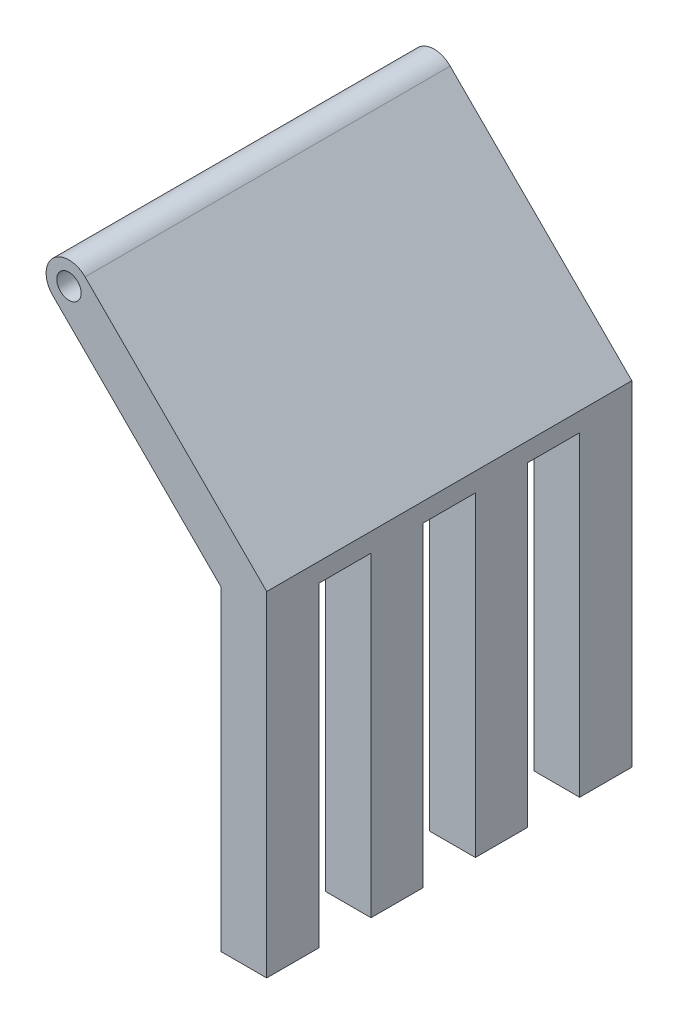
ISO-10303-21;
HEADER;
FILE_DESCRIPTION(('STEP AP214'),'2;1');
FILE_NAME('part.step','',(''),(''),'','','');
FILE_SCHEMA(('AUTOMOTIVE_DESIGN { 1 0 10303 214 1 1 1 1 }'));
ENDSEC;
DATA;
#1=APPLICATION_CONTEXT('core data for automotive mechanical design processes');
#2=APPLICATION_PROTOCOL_DEFINITION('international standard','automotive_design',2000,#1);
#3=PRODUCT_CONTEXT('',#1,'mechanical');
#4=PRODUCT('Part','Part','',(#3));
#5=PRODUCT_RELATED_PRODUCT_CATEGORY('part','',(#4));
#6=PRODUCT_DEFINITION_FORMATION('','',#4);
#7=PRODUCT_DEFINITION_CONTEXT('part definition',#1,'design');
#8=PRODUCT_DEFINITION('design','',#6,#7);
#9=PRODUCT_DEFINITION_SHAPE('','',#8);
#10=(LENGTH_UNIT() NAMED_UNIT(*) SI_UNIT(.MILLI.,.METRE.));
#11=(NAMED_UNIT(*) PLANE_ANGLE_UNIT() SI_UNIT($,.RADIAN.));
#12=(NAMED_UNIT(*) SI_UNIT($,.STERADIAN.) SOLID_ANGLE_UNIT());
#13=UNCERTAINTY_MEASURE_WITH_UNIT(LENGTH_MEASURE(1.E-05),#10,'distance_accuracy_value','');
#14=(GEOMETRIC_REPRESENTATION_CONTEXT(3) GLOBAL_UNCERTAINTY_ASSIGNED_CONTEXT((#13)) GLOBAL_UNIT_ASSIGNED_CONTEXT((#10,
#11,#12)) REPRESENTATION_CONTEXT('',''));
#15=CARTESIAN_POINT('',(0.,0.,0.));
#16=DIRECTION('',(0.,0.,1.));
#17=DIRECTION('',(1.,0.,0.));
#18=AXIS2_PLACEMENT_3D('',#15,#16,#17);
#19=CARTESIAN_POINT('',(0.,0.,60.));
#20=DIRECTION('',(0.,1.,0.));
#21=DIRECTION('',(0.,0.,1.));
#22=AXIS2_PLACEMENT_3D('',#19,#20,#21);
#23=PLANE('',#22);
#24=DIRECTION('',(0.,0.,-1.));
#25=VECTOR('',#24,1.);
#26=CARTESIAN_POINT('',(7.5,0.,60.));
#27=LINE('',#26,#25);
#28=CARTESIAN_POINT('',(7.5,0.,8.57142857142857));
#29=VERTEX_POINT('',#28);
#30=CARTESIAN_POINT('',(7.5,0.,0.));
#31=VERTEX_POINT('',#30);
#32=EDGE_CURVE('E44',#29,#31,#27,.T.);
#33=ORIENTED_EDGE('',*,*,#32,.F.);
#34=DIRECTION('',(-1.,0.,0.));
#35=VECTOR('',#34,1.);
#36=CARTESIAN_POINT('',(7.5,0.,8.57142857142857));
#37=LINE('',#36,#35);
#38=CARTESIAN_POINT('',(0.,0.,8.57142857142857));
#39=VERTEX_POINT('',#38);
#40=EDGE_CURVE('E276',#29,#39,#37,.T.);
#41=ORIENTED_EDGE('',*,*,#40,.T.);
#42=DIRECTION('',(0.,0.,-1.));
#43=VECTOR('',#42,1.);
#44=CARTESIAN_POINT('',(0.,0.,60.));
#45=LINE('',#44,#43);
#46=CARTESIAN_POINT('',(0.,0.,0.));
#47=VERTEX_POINT('',#46);
#48=EDGE_CURVE('E218',#39,#47,#45,.T.);
#49=ORIENTED_EDGE('',*,*,#48,.T.);
#50=DIRECTION('',(1.,0.,0.));
#51=VECTOR('',#50,1.);
#52=CARTESIAN_POINT('',(0.,0.,0.));
#53=LINE('',#52,#51);
#54=EDGE_CURVE('E232',#47,#31,#53,.T.);
#55=ORIENTED_EDGE('',*,*,#54,.T.);
#56=EDGE_LOOP('',(#33,#41,#49,#55));
#57=FACE_BOUND('',#56,.T.);
#58=ADVANCED_FACE('F35',(#57),#23,.F.);
#59=CARTESIAN_POINT('',(7.5,0.,42.8571428571429));
#60=VERTEX_POINT('',#59);
#61=CARTESIAN_POINT('',(7.5,0.,34.2857142857143));
#62=VERTEX_POINT('',#61);
#63=EDGE_CURVE('E43',#60,#62,#27,.T.);
#64=ORIENTED_EDGE('',*,*,#63,.F.);
#65=DIRECTION('',(-1.,0.,0.));
#66=VECTOR('',#65,1.);
#67=CARTESIAN_POINT('',(7.5,0.,42.8571428571429));
#68=LINE('',#67,#66);
#69=CARTESIAN_POINT('',(0.,0.,42.8571428571429));
#70=VERTEX_POINT('',#69);
#71=EDGE_CURVE('E163',#60,#70,#68,.T.);
#72=ORIENTED_EDGE('',*,*,#71,.T.);
#73=CARTESIAN_POINT('',(0.,0.,34.2857142857143));
#74=VERTEX_POINT('',#73);
#75=EDGE_CURVE('E217',#70,#74,#45,.T.);
#76=ORIENTED_EDGE('',*,*,#75,.T.);
#77=DIRECTION('',(-1.,0.,0.));
#78=VECTOR('',#77,1.);
#79=CARTESIAN_POINT('',(7.5,0.,34.2857142857143));
#80=LINE('',#79,#78);
#81=EDGE_CURVE('E59',#62,#74,#80,.T.);
#82=ORIENTED_EDGE('',*,*,#81,.F.);
#83=EDGE_LOOP('',(#64,#72,#76,#82));
#84=FACE_BOUND('',#83,.T.);
#85=ADVANCED_FACE('F187',(#84),#23,.F.);
#86=CARTESIAN_POINT('',(0.,0.,25.7142857142857));
#87=VERTEX_POINT('',#86);
#88=CARTESIAN_POINT('',(0.,0.,17.1428571428571));
#89=VERTEX_POINT('',#88);
#90=EDGE_CURVE('E331',#87,#89,#45,.T.);
#91=ORIENTED_EDGE('',*,*,#90,.T.);
#92=DIRECTION('',(-1.,0.,0.));
#93=VECTOR('',#92,1.);
#94=CARTESIAN_POINT('',(7.5,0.,17.1428571428571));
#95=LINE('',#94,#93);
#96=CARTESIAN_POINT('',(7.5,0.,17.1428571428571));
#97=VERTEX_POINT('',#96);
#98=EDGE_CURVE('E51',#97,#89,#95,.T.);
#99=ORIENTED_EDGE('',*,*,#98,.F.);
#100=CARTESIAN_POINT('',(7.5,0.,25.7142857142857));
#101=VERTEX_POINT('',#100);
#102=EDGE_CURVE('E188',#101,#97,#27,.T.);
#103=ORIENTED_EDGE('',*,*,#102,.F.);
#104=DIRECTION('',(-1.,0.,0.));
#105=VECTOR('',#104,1.);
#106=CARTESIAN_POINT('',(7.5,0.,25.7142857142857));
#107=LINE('',#106,#105);
#108=EDGE_CURVE('E254',#101,#87,#107,.T.);
#109=ORIENTED_EDGE('',*,*,#108,.T.);
#110=EDGE_LOOP('',(#91,#99,#103,#109));
#111=FACE_BOUND('',#110,.T.);
#112=ADVANCED_FACE('F369',(#111),#23,.F.);
#113=CARTESIAN_POINT('',(0.,0.,60.));
#114=DIRECTION('',(1.,0.,0.));
#115=DIRECTION('',(0.,1.,0.));
#116=AXIS2_PLACEMENT_3D('',#113,#114,#115);
#117=PLANE('',#116);
#118=ORIENTED_EDGE('',*,*,#48,.F.);
#119=DIRECTION('',(0.,-1.,0.));
#120=VECTOR('',#119,1.);
#121=CARTESIAN_POINT('',(0.,51.8933982822018,8.57142857142856));
#122=LINE('',#121,#120);
#123=CARTESIAN_POINT('',(0.,51.8933982822018,8.57142857142856));
#124=VERTEX_POINT('',#123);
#125=EDGE_CURVE('E291',#124,#39,#122,.T.);
#126=ORIENTED_EDGE('',*,*,#125,.F.);
#127=DIRECTION('',(0.,0.,-1.));
#128=VECTOR('',#127,1.);
#129=CARTESIAN_POINT('',(0.,51.8933982822018,60.));
#130=LINE('',#129,#128);
#131=CARTESIAN_POINT('',(0.,51.8933982822018,0.));
#132=VERTEX_POINT('',#131);
#133=EDGE_CURVE('E213',#124,#132,#130,.T.);
#134=ORIENTED_EDGE('',*,*,#133,.T.);
#135=DIRECTION('',(0.,-1.,0.));
#136=VECTOR('',#135,1.);
#137=CARTESIAN_POINT('',(0.,0.,0.));
#138=LINE('',#137,#136);
#139=EDGE_CURVE('E219',#132,#47,#138,.T.);
#140=ORIENTED_EDGE('',*,*,#139,.T.);
#141=EDGE_LOOP('',(#118,#126,#134,#140));
#142=FACE_BOUND('',#141,.T.);
#143=ADVANCED_FACE('F341',(#142),#117,.F.);
#144=ORIENTED_EDGE('',*,*,#75,.F.);
#145=DIRECTION('',(0.,-1.,0.));
#146=VECTOR('',#145,1.);
#147=CARTESIAN_POINT('',(0.,51.8933982822018,42.8571428571429));
#148=LINE('',#147,#146);
#149=CARTESIAN_POINT('',(0.,51.8933982822018,42.8571428571429));
#150=VERTEX_POINT('',#149);
#151=EDGE_CURVE('E169',#150,#70,#148,.T.);
#152=ORIENTED_EDGE('',*,*,#151,.F.);
#153=CARTESIAN_POINT('',(0.,51.8933982822018,34.2857142857143));
#154=VERTEX_POINT('',#153);
#155=EDGE_CURVE('E212',#150,#154,#130,.T.);
#156=ORIENTED_EDGE('',*,*,#155,.T.);
#157=DIRECTION('',(0.,1.,0.));
#158=VECTOR('',#157,1.);
#159=CARTESIAN_POINT('',(0.,51.8933982822018,34.2857142857143));
#160=LINE('',#159,#158);
#161=EDGE_CURVE('E266',#74,#154,#160,.T.);
#162=ORIENTED_EDGE('',*,*,#161,.F.);
#163=EDGE_LOOP('',(#144,#152,#156,#162));
#164=FACE_BOUND('',#163,.T.);
#165=ADVANCED_FACE('F330',(#164),#117,.F.);
#166=CARTESIAN_POINT('',(0.,51.8933982822018,25.7142857142857));
#167=VERTEX_POINT('',#166);
#168=CARTESIAN_POINT('',(0.,51.8933982822018,17.1428571428571));
#169=VERTEX_POINT('',#168);
#170=EDGE_CURVE('E402',#167,#169,#130,.T.);
#171=ORIENTED_EDGE('',*,*,#170,.T.);
#172=DIRECTION('',(0.,1.,0.));
#173=VECTOR('',#172,1.);
#174=CARTESIAN_POINT('',(0.,51.8933982822018,17.1428571428571));
#175=LINE('',#174,#173);
#176=EDGE_CURVE('E289',#89,#169,#175,.T.);
#177=ORIENTED_EDGE('',*,*,#176,.F.);
#178=ORIENTED_EDGE('',*,*,#90,.F.);
#179=DIRECTION('',(0.,-1.,0.));
#180=VECTOR('',#179,1.);
#181=CARTESIAN_POINT('',(0.,51.8933982822018,25.7142857142857));
#182=LINE('',#181,#180);
#183=EDGE_CURVE('E268',#167,#87,#182,.T.);
#184=ORIENTED_EDGE('',*,*,#183,.F.);
#185=EDGE_LOOP('',(#171,#177,#178,#184));
#186=FACE_BOUND('',#185,.T.);
#187=ADVANCED_FACE('F384',(#186),#117,.F.);
#188=CARTESIAN_POINT('',(-25.,82.1966991411008,60.));
#189=DIRECTION('',(0.,0.,-1.));
#190=DIRECTION('',(-1.,0.,0.));
#191=AXIS2_PLACEMENT_3D('',#188,#189,#190);
#192=PLANE('',#191);
#193=DIRECTION('',(1.,0.,0.));
#194=VECTOR('',#193,1.);
#195=CARTESIAN_POINT('',(0.,0.,60.));
#196=LINE('',#195,#194);
#197=CARTESIAN_POINT('',(0.,0.,60.));
#198=VERTEX_POINT('',#197);
#199=CARTESIAN_POINT('',(7.5,0.,60.));
#200=VERTEX_POINT('',#199);
#201=EDGE_CURVE('E222',#198,#200,#196,.T.);
#202=ORIENTED_EDGE('',*,*,#201,.T.);
#203=DIRECTION('',(0.,1.,0.));
#204=VECTOR('',#203,1.);
#205=CARTESIAN_POINT('',(7.5,0.,60.));
#206=LINE('',#205,#204);
#207=CARTESIAN_POINT('',(7.5,55.,60.));
#208=VERTEX_POINT('',#207);
#209=EDGE_CURVE('E244',#200,#208,#206,.T.);
#210=ORIENTED_EDGE('',*,*,#209,.T.);
#211=DIRECTION('',(-0.707106781186549,0.707106781186546,0.));
#212=VECTOR('',#211,1.);
#213=CARTESIAN_POINT('',(7.5,55.,60.));
#214=LINE('',#213,#212);
#215=CARTESIAN_POINT('',(-22.3483495705505,84.8483495705503,60.));
#216=VERTEX_POINT('',#215);
#217=EDGE_CURVE('E242',#208,#216,#214,.T.);
#218=ORIENTED_EDGE('',*,*,#217,.T.);
#219=CARTESIAN_POINT('',(-25.,82.1966991411008,60.));
#220=DIRECTION('',(0.,0.,1.));
#221=DIRECTION('',(-1.,0.,0.));
#222=AXIS2_PLACEMENT_3D('',#219,#220,#221);
#223=CIRCLE('',#222,3.75);
#224=CARTESIAN_POINT('',(-27.6516504294495,79.5450487116512,60.));
#225=VERTEX_POINT('',#224);
#226=EDGE_CURVE('E240',#216,#225,#223,.T.);
#227=ORIENTED_EDGE('',*,*,#226,.T.);
#228=DIRECTION('',(0.707106781186549,-0.707106781186546,0.));
#229=VECTOR('',#228,1.);
#230=CARTESIAN_POINT('',(0.,51.8933982822018,60.));
#231=LINE('',#230,#229);
#232=CARTESIAN_POINT('',(0.,51.8933982822018,60.));
#233=VERTEX_POINT('',#232);
#234=EDGE_CURVE('E238',#225,#233,#231,.T.);
#235=ORIENTED_EDGE('',*,*,#234,.T.);
#236=DIRECTION('',(0.,-1.,0.));
#237=VECTOR('',#236,1.);
#238=CARTESIAN_POINT('',(0.,0.,60.));
#239=LINE('',#238,#237);
#240=EDGE_CURVE('E236',#233,#198,#239,.T.);
#241=ORIENTED_EDGE('',*,*,#240,.T.);
#242=EDGE_LOOP('',(#202,#210,#218,#227,#235,#241));
#243=FACE_BOUND('',#242,.T.);
#244=CARTESIAN_POINT('',(-25.,82.1966991411008,60.));
#245=DIRECTION('',(0.,0.,1.));
#246=DIRECTION('',(1.,0.,0.));
#247=AXIS2_PLACEMENT_3D('',#244,#245,#246);
#248=CIRCLE('',#247,2.);
#249=CARTESIAN_POINT('',(-23.,82.1966991411008,60.));
#250=VERTEX_POINT('',#249);
#251=EDGE_CURVE('E235',#250,#250,#248,.T.);
#252=ORIENTED_EDGE('',*,*,#251,.F.);
#253=EDGE_LOOP('',(#252));
#254=FACE_BOUND('',#253,.T.);
#255=ADVANCED_FACE('F352',(#243,#254),#192,.F.);
#256=CARTESIAN_POINT('',(-25.,82.1966991411008,0.));
#257=DIRECTION('',(0.,0.,-1.));
#258=DIRECTION('',(-1.,0.,0.));
#259=AXIS2_PLACEMENT_3D('',#256,#257,#258);
#260=PLANE('',#259);
#261=ORIENTED_EDGE('',*,*,#54,.F.);
#262=ORIENTED_EDGE('',*,*,#139,.F.);
#263=DIRECTION('',(0.707106781186549,-0.707106781186546,0.));
#264=VECTOR('',#263,1.);
#265=CARTESIAN_POINT('',(0.,51.8933982822018,0.));
#266=LINE('',#265,#264);
#267=CARTESIAN_POINT('',(-27.6516504294495,79.5450487116512,0.));
#268=VERTEX_POINT('',#267);
#269=EDGE_CURVE('E223',#268,#132,#266,.T.);
#270=ORIENTED_EDGE('',*,*,#269,.F.);
#271=CARTESIAN_POINT('',(-25.,82.1966991411008,0.));
#272=DIRECTION('',(0.,0.,1.));
#273=DIRECTION('',(-1.,0.,0.));
#274=AXIS2_PLACEMENT_3D('',#271,#272,#273);
#275=CIRCLE('',#274,3.75);
#276=CARTESIAN_POINT('',(-22.3483495705505,84.8483495705503,0.));
#277=VERTEX_POINT('',#276);
#278=EDGE_CURVE('E226',#277,#268,#275,.T.);
#279=ORIENTED_EDGE('',*,*,#278,.F.);
#280=DIRECTION('',(-0.707106781186549,0.707106781186546,0.));
#281=VECTOR('',#280,1.);
#282=CARTESIAN_POINT('',(7.5,55.,0.));
#283=LINE('',#282,#281);
#284=CARTESIAN_POINT('',(7.5,55.,0.));
#285=VERTEX_POINT('',#284);
#286=EDGE_CURVE('E228',#285,#277,#283,.T.);
#287=ORIENTED_EDGE('',*,*,#286,.F.);
#288=DIRECTION('',(0.,1.,0.));
#289=VECTOR('',#288,1.);
#290=CARTESIAN_POINT('',(7.5,0.,0.));
#291=LINE('',#290,#289);
#292=EDGE_CURVE('E230',#31,#285,#291,.T.);
#293=ORIENTED_EDGE('',*,*,#292,.F.);
#294=EDGE_LOOP('',(#261,#262,#270,#279,#287,#293));
#295=FACE_BOUND('',#294,.T.);
#296=CARTESIAN_POINT('',(-25.,82.1966991411008,0.));
#297=DIRECTION('',(0.,0.,1.));
#298=DIRECTION('',(1.,0.,0.));
#299=AXIS2_PLACEMENT_3D('',#296,#297,#298);
#300=CIRCLE('',#299,2.);
#301=CARTESIAN_POINT('',(-23.,82.1966991411008,0.));
#302=VERTEX_POINT('',#301);
#303=EDGE_CURVE('E248',#302,#302,#300,.T.);
#304=ORIENTED_EDGE('',*,*,#303,.T.);
#305=EDGE_LOOP('',(#304));
#306=FACE_BOUND('',#305,.T.);
#307=ADVANCED_FACE('F345',(#295,#306),#260,.T.);
#308=CARTESIAN_POINT('',(0.,0.,51.4285714285714));
#309=VERTEX_POINT('',#308);
#310=EDGE_CURVE('E214',#198,#309,#45,.T.);
#311=ORIENTED_EDGE('',*,*,#310,.T.);
#312=DIRECTION('',(-1.,0.,0.));
#313=VECTOR('',#312,1.);
#314=CARTESIAN_POINT('',(7.5,0.,51.4285714285714));
#315=LINE('',#314,#313);
#316=CARTESIAN_POINT('',(7.5,0.,51.4285714285714));
#317=VERTEX_POINT('',#316);
#318=EDGE_CURVE('E174',#317,#309,#315,.T.);
#319=ORIENTED_EDGE('',*,*,#318,.F.);
#320=EDGE_CURVE('E11',#200,#317,#27,.T.);
#321=ORIENTED_EDGE('',*,*,#320,.F.);
#322=ORIENTED_EDGE('',*,*,#201,.F.);
#323=EDGE_LOOP('',(#311,#319,#321,#322));
#324=FACE_BOUND('',#323,.T.);
#325=ADVANCED_FACE('F37',(#324),#23,.F.);
#326=CARTESIAN_POINT('',(7.5,0.,60.));
#327=DIRECTION('',(-1.,0.,0.));
#328=DIRECTION('',(0.,0.,1.));
#329=AXIS2_PLACEMENT_3D('',#326,#327,#328);
#330=PLANE('',#329);
#331=DIRECTION('',(0.,0.,-1.));
#332=VECTOR('',#331,1.);
#333=CARTESIAN_POINT('',(7.5,51.8933982822018,8.57142857142856));
#334=LINE('',#333,#332);
#335=CARTESIAN_POINT('',(7.5,51.8933982822018,17.1428571428571));
#336=VERTEX_POINT('',#335);
#337=CARTESIAN_POINT('',(7.5,51.8933982822018,8.57142857142856));
#338=VERTEX_POINT('',#337);
#339=EDGE_CURVE('E279',#336,#338,#334,.T.);
#340=ORIENTED_EDGE('',*,*,#339,.T.);
#341=DIRECTION('',(0.,-1.,0.));
#342=VECTOR('',#341,1.);
#343=CARTESIAN_POINT('',(7.5,51.8933982822018,8.57142857142856));
#344=LINE('',#343,#342);
#345=EDGE_CURVE('E288',#338,#29,#344,.T.);
#346=ORIENTED_EDGE('',*,*,#345,.T.);
#347=ORIENTED_EDGE('',*,*,#32,.T.);
#348=ORIENTED_EDGE('',*,*,#292,.T.);
#349=DIRECTION('',(0.,0.,-1.));
#350=VECTOR('',#349,1.);
#351=CARTESIAN_POINT('',(7.5,55.,60.));
#352=LINE('',#351,#350);
#353=EDGE_CURVE('E193',#208,#285,#352,.T.);
#354=ORIENTED_EDGE('',*,*,#353,.F.);
#355=ORIENTED_EDGE('',*,*,#209,.F.);
#356=ORIENTED_EDGE('',*,*,#320,.T.);
#357=DIRECTION('',(0.,1.,0.));
#358=VECTOR('',#357,1.);
#359=CARTESIAN_POINT('',(7.5,51.8933982822018,51.4285714285714));
#360=LINE('',#359,#358);
#361=CARTESIAN_POINT('',(7.5,51.8933982822018,51.4285714285714));
#362=VERTEX_POINT('',#361);
#363=EDGE_CURVE('E184',#317,#362,#360,.T.);
#364=ORIENTED_EDGE('',*,*,#363,.T.);
#365=DIRECTION('',(0.,0.,-1.));
#366=VECTOR('',#365,1.);
#367=CARTESIAN_POINT('',(7.5,51.8933982822018,42.8571428571429));
#368=LINE('',#367,#366);
#369=CARTESIAN_POINT('',(7.5,51.8933982822018,42.8571428571429));
#370=VERTEX_POINT('',#369);
#371=EDGE_CURVE('E175',#362,#370,#368,.T.);
#372=ORIENTED_EDGE('',*,*,#371,.T.);
#373=DIRECTION('',(0.,-1.,0.));
#374=VECTOR('',#373,1.);
#375=CARTESIAN_POINT('',(7.5,51.8933982822018,42.8571428571429));
#376=LINE('',#375,#374);
#377=EDGE_CURVE('E166',#370,#60,#376,.T.);
#378=ORIENTED_EDGE('',*,*,#377,.T.);
#379=ORIENTED_EDGE('',*,*,#63,.T.);
#380=DIRECTION('',(0.,1.,0.));
#381=VECTOR('',#380,1.);
#382=CARTESIAN_POINT('',(7.5,51.8933982822018,34.2857142857143));
#383=LINE('',#382,#381);
#384=CARTESIAN_POINT('',(7.5,51.8933982822018,34.2857142857143));
#385=VERTEX_POINT('',#384);
#386=EDGE_CURVE('E273',#62,#385,#383,.T.);
#387=ORIENTED_EDGE('',*,*,#386,.T.);
#388=DIRECTION('',(0.,0.,-1.));
#389=VECTOR('',#388,1.);
#390=CARTESIAN_POINT('',(7.5,51.8933982822018,25.7142857142857));
#391=LINE('',#390,#389);
#392=CARTESIAN_POINT('',(7.5,51.8933982822018,25.7142857142857));
#393=VERTEX_POINT('',#392);
#394=EDGE_CURVE('E257',#385,#393,#391,.T.);
#395=ORIENTED_EDGE('',*,*,#394,.T.);
#396=DIRECTION('',(0.,-1.,0.));
#397=VECTOR('',#396,1.);
#398=CARTESIAN_POINT('',(7.5,51.8933982822018,25.7142857142857));
#399=LINE('',#398,#397);
#400=EDGE_CURVE('E265',#393,#101,#399,.T.);
#401=ORIENTED_EDGE('',*,*,#400,.T.);
#402=ORIENTED_EDGE('',*,*,#102,.T.);
#403=DIRECTION('',(0.,1.,0.));
#404=VECTOR('',#403,1.);
#405=CARTESIAN_POINT('',(7.5,51.8933982822018,17.1428571428571));
#406=LINE('',#405,#404);
#407=EDGE_CURVE('E294',#97,#336,#406,.T.);
#408=ORIENTED_EDGE('',*,*,#407,.T.);
#409=EDGE_LOOP('',(#340,#346,#347,#348,#354,#355,#356,#364,#372,#378,#379,#387,#395,#401,#402,#408));
#410=FACE_BOUND('',#409,.T.);
#411=ADVANCED_FACE('F180',(#410),#330,.F.);
#412=CARTESIAN_POINT('',(7.5,55.,60.));
#413=DIRECTION('',(-0.707106781186546,-0.707106781186549,0.));
#414=DIRECTION('',(0.707106781186549,-0.707106781186546,0.));
#415=AXIS2_PLACEMENT_3D('',#412,#413,#414);
#416=PLANE('',#415);
#417=ORIENTED_EDGE('',*,*,#286,.T.);
#418=DIRECTION('',(0.,0.,-1.));
#419=VECTOR('',#418,1.);
#420=CARTESIAN_POINT('',(-22.3483495705505,84.8483495705503,60.));
#421=LINE('',#420,#419);
#422=EDGE_CURVE('E198',#216,#277,#421,.T.);
#423=ORIENTED_EDGE('',*,*,#422,.F.);
#424=ORIENTED_EDGE('',*,*,#217,.F.);
#425=ORIENTED_EDGE('',*,*,#353,.T.);
#426=EDGE_LOOP('',(#417,#423,#424,#425));
#427=FACE_BOUND('',#426,.T.);
#428=ADVANCED_FACE('F349',(#427),#416,.F.);
#429=CARTESIAN_POINT('',(-25.,82.1966991411008,60.));
#430=DIRECTION('',(0.,0.,-1.));
#431=DIRECTION('',(-1.,0.,0.));
#432=AXIS2_PLACEMENT_3D('',#429,#430,#431);
#433=CYLINDRICAL_SURFACE('',#432,3.75);
#434=ORIENTED_EDGE('',*,*,#278,.T.);
#435=DIRECTION('',(0.,0.,-1.));
#436=VECTOR('',#435,1.);
#437=CARTESIAN_POINT('',(-27.6516504294495,79.5450487116512,60.));
#438=LINE('',#437,#436);
#439=EDGE_CURVE('E204',#225,#268,#438,.T.);
#440=ORIENTED_EDGE('',*,*,#439,.F.);
#441=ORIENTED_EDGE('',*,*,#226,.F.);
#442=ORIENTED_EDGE('',*,*,#422,.T.);
#443=EDGE_LOOP('',(#434,#440,#441,#442));
#444=FACE_BOUND('',#443,.T.);
#445=ADVANCED_FACE('F356',(#444),#433,.T.);
#446=CARTESIAN_POINT('',(0.,51.8933982822018,60.));
#447=DIRECTION('',(0.707106781186546,0.707106781186549,0.));
#448=DIRECTION('',(-0.707106781186549,0.707106781186546,0.));
#449=AXIS2_PLACEMENT_3D('',#446,#447,#448);
#450=PLANE('',#449);
#451=ORIENTED_EDGE('',*,*,#269,.T.);
#452=ORIENTED_EDGE('',*,*,#133,.F.);
#453=DIRECTION('',(0.,0.,-1.));
#454=VECTOR('',#453,1.);
#455=CARTESIAN_POINT('',(0.,51.8933982822018,8.57142857142856));
#456=LINE('',#455,#454);
#457=EDGE_CURVE('E285',#169,#124,#456,.T.);
#458=ORIENTED_EDGE('',*,*,#457,.F.);
#459=ORIENTED_EDGE('',*,*,#170,.F.);
#460=DIRECTION('',(0.,0.,-1.));
#461=VECTOR('',#460,1.);
#462=CARTESIAN_POINT('',(0.,51.8933982822018,25.7142857142857));
#463=LINE('',#462,#461);
#464=EDGE_CURVE('E262',#154,#167,#463,.T.);
#465=ORIENTED_EDGE('',*,*,#464,.F.);
#466=ORIENTED_EDGE('',*,*,#155,.F.);
#467=DIRECTION('',(0.,0.,-1.));
#468=VECTOR('',#467,1.);
#469=CARTESIAN_POINT('',(0.,51.8933982822018,42.8571428571429));
#470=LINE('',#469,#468);
#471=CARTESIAN_POINT('',(0.,51.8933982822018,51.4285714285714));
#472=VERTEX_POINT('',#471);
#473=EDGE_CURVE('E185',#472,#150,#470,.T.);
#474=ORIENTED_EDGE('',*,*,#473,.F.);
#475=EDGE_CURVE('E209',#233,#472,#130,.T.);
#476=ORIENTED_EDGE('',*,*,#475,.F.);
#477=ORIENTED_EDGE('',*,*,#234,.F.);
#478=ORIENTED_EDGE('',*,*,#439,.T.);
#479=EDGE_LOOP('',(#451,#452,#458,#459,#465,#466,#474,#476,#477,#478));
#480=FACE_BOUND('',#479,.T.);
#481=ADVANCED_FACE('F323',(#480),#450,.F.);
#482=ORIENTED_EDGE('',*,*,#475,.T.);
#483=DIRECTION('',(0.,1.,0.));
#484=VECTOR('',#483,1.);
#485=CARTESIAN_POINT('',(0.,51.8933982822018,51.4285714285714));
#486=LINE('',#485,#484);
#487=EDGE_CURVE('E303',#309,#472,#486,.T.);
#488=ORIENTED_EDGE('',*,*,#487,.F.);
#489=ORIENTED_EDGE('',*,*,#310,.F.);
#490=ORIENTED_EDGE('',*,*,#240,.F.);
#491=EDGE_LOOP('',(#482,#488,#489,#490));
#492=FACE_BOUND('',#491,.T.);
#493=ADVANCED_FACE('F318',(#492),#117,.F.);
#494=CARTESIAN_POINT('',(-25.,82.1966991411008,60.));
#495=DIRECTION('',(0.,0.,-1.));
#496=DIRECTION('',(-1.,0.,0.));
#497=AXIS2_PLACEMENT_3D('',#494,#495,#496);
#498=CYLINDRICAL_SURFACE('',#497,2.);
#499=ORIENTED_EDGE('',*,*,#251,.T.);
#500=EDGE_LOOP('',(#499));
#501=FACE_BOUND('',#500,.T.);
#502=ORIENTED_EDGE('',*,*,#303,.F.);
#503=EDGE_LOOP('',(#502));
#504=FACE_BOUND('',#503,.T.);
#505=ADVANCED_FACE('F386',(#501,#504),#498,.F.);
#506=CARTESIAN_POINT('',(7.5,51.8933982822018,25.7142857142857));
#507=DIRECTION('',(0.,0.,-1.));
#508=DIRECTION('',(0.,1.,0.));
#509=AXIS2_PLACEMENT_3D('',#506,#507,#508);
#510=PLANE('',#509);
#511=ORIENTED_EDGE('',*,*,#183,.T.);
#512=ORIENTED_EDGE('',*,*,#108,.F.);
#513=ORIENTED_EDGE('',*,*,#400,.F.);
#514=DIRECTION('',(-1.,0.,0.));
#515=VECTOR('',#514,1.);
#516=CARTESIAN_POINT('',(7.5,51.8933982822018,25.7142857142857));
#517=LINE('',#516,#515);
#518=EDGE_CURVE('E251',#393,#167,#517,.T.);
#519=ORIENTED_EDGE('',*,*,#518,.T.);
#520=EDGE_LOOP('',(#511,#512,#513,#519));
#521=FACE_BOUND('',#520,.T.);
#522=ADVANCED_FACE('F390',(#521),#510,.F.);
#523=CARTESIAN_POINT('',(7.5,51.8933982822018,25.7142857142857));
#524=DIRECTION('',(0.,1.,0.));
#525=DIRECTION('',(-1.,0.,0.));
#526=AXIS2_PLACEMENT_3D('',#523,#524,#525);
#527=PLANE('',#526);
#528=ORIENTED_EDGE('',*,*,#464,.T.);
#529=ORIENTED_EDGE('',*,*,#518,.F.);
#530=ORIENTED_EDGE('',*,*,#394,.F.);
#531=DIRECTION('',(-1.,0.,0.));
#532=VECTOR('',#531,1.);
#533=CARTESIAN_POINT('',(7.5,51.8933982822018,34.2857142857143));
#534=LINE('',#533,#532);
#535=EDGE_CURVE('E259',#385,#154,#534,.T.);
#536=ORIENTED_EDGE('',*,*,#535,.T.);
#537=EDGE_LOOP('',(#528,#529,#530,#536));
#538=FACE_BOUND('',#537,.T.);
#539=ADVANCED_FACE('F415',(#538),#527,.F.);
#540=CARTESIAN_POINT('',(7.5,51.8933982822018,34.2857142857143));
#541=DIRECTION('',(0.,0.,1.));
#542=DIRECTION('',(0.,-1.,0.));
#543=AXIS2_PLACEMENT_3D('',#540,#541,#542);
#544=PLANE('',#543);
#545=ORIENTED_EDGE('',*,*,#161,.T.);
#546=ORIENTED_EDGE('',*,*,#535,.F.);
#547=ORIENTED_EDGE('',*,*,#386,.F.);
#548=ORIENTED_EDGE('',*,*,#81,.T.);
#549=EDGE_LOOP('',(#545,#546,#547,#548));
#550=FACE_BOUND('',#549,.T.);
#551=ADVANCED_FACE('F416',(#550),#544,.F.);
#552=CARTESIAN_POINT('',(7.5,51.8933982822018,42.8571428571429));
#553=DIRECTION('',(0.,0.,-1.));
#554=DIRECTION('',(0.,1.,0.));
#555=AXIS2_PLACEMENT_3D('',#552,#553,#554);
#556=PLANE('',#555);
#557=ORIENTED_EDGE('',*,*,#151,.T.);
#558=ORIENTED_EDGE('',*,*,#71,.F.);
#559=ORIENTED_EDGE('',*,*,#377,.F.);
#560=DIRECTION('',(-1.,0.,0.));
#561=VECTOR('',#560,1.);
#562=CARTESIAN_POINT('',(7.5,51.8933982822018,42.8571428571429));
#563=LINE('',#562,#561);
#564=EDGE_CURVE('E270',#370,#150,#563,.T.);
#565=ORIENTED_EDGE('',*,*,#564,.T.);
#566=EDGE_LOOP('',(#557,#558,#559,#565));
#567=FACE_BOUND('',#566,.T.);
#568=ADVANCED_FACE('F165',(#567),#556,.F.);
#569=CARTESIAN_POINT('',(7.5,51.8933982822018,42.8571428571429));
#570=DIRECTION('',(0.,1.,0.));
#571=DIRECTION('',(-1.,0.,0.));
#572=AXIS2_PLACEMENT_3D('',#569,#570,#571);
#573=PLANE('',#572);
#574=ORIENTED_EDGE('',*,*,#473,.T.);
#575=ORIENTED_EDGE('',*,*,#564,.F.);
#576=ORIENTED_EDGE('',*,*,#371,.F.);
#577=DIRECTION('',(-1.,0.,0.));
#578=VECTOR('',#577,1.);
#579=CARTESIAN_POINT('',(7.5,51.8933982822018,51.4285714285714));
#580=LINE('',#579,#578);
#581=EDGE_CURVE('E298',#362,#472,#580,.T.);
#582=ORIENTED_EDGE('',*,*,#581,.T.);
#583=EDGE_LOOP('',(#574,#575,#576,#582));
#584=FACE_BOUND('',#583,.T.);
#585=ADVANCED_FACE('F328',(#584),#573,.F.);
#586=CARTESIAN_POINT('',(7.5,51.8933982822018,51.4285714285714));
#587=DIRECTION('',(0.,0.,1.));
#588=DIRECTION('',(0.,-1.,0.));
#589=AXIS2_PLACEMENT_3D('',#586,#587,#588);
#590=PLANE('',#589);
#591=ORIENTED_EDGE('',*,*,#487,.T.);
#592=ORIENTED_EDGE('',*,*,#581,.F.);
#593=ORIENTED_EDGE('',*,*,#363,.F.);
#594=ORIENTED_EDGE('',*,*,#318,.T.);
#595=EDGE_LOOP('',(#591,#592,#593,#594));
#596=FACE_BOUND('',#595,.T.);
#597=ADVANCED_FACE('F311',(#596),#590,.F.);
#598=CARTESIAN_POINT('',(7.5,51.8933982822018,8.57142857142856));
#599=DIRECTION('',(0.,0.,-1.));
#600=DIRECTION('',(0.,1.,0.));
#601=AXIS2_PLACEMENT_3D('',#598,#599,#600);
#602=PLANE('',#601);
#603=ORIENTED_EDGE('',*,*,#125,.T.);
#604=ORIENTED_EDGE('',*,*,#40,.F.);
#605=ORIENTED_EDGE('',*,*,#345,.F.);
#606=DIRECTION('',(-1.,0.,0.));
#607=VECTOR('',#606,1.);
#608=CARTESIAN_POINT('',(7.5,51.8933982822018,8.57142857142856));
#609=LINE('',#608,#607);
#610=EDGE_CURVE('E283',#338,#124,#609,.T.);
#611=ORIENTED_EDGE('',*,*,#610,.T.);
#612=EDGE_LOOP('',(#603,#604,#605,#611));
#613=FACE_BOUND('',#612,.T.);
#614=ADVANCED_FACE('F409',(#613),#602,.F.);
#615=CARTESIAN_POINT('',(7.5,51.8933982822018,8.57142857142856));
#616=DIRECTION('',(0.,1.,0.));
#617=DIRECTION('',(-1.,0.,0.));
#618=AXIS2_PLACEMENT_3D('',#615,#616,#617);
#619=PLANE('',#618);
#620=ORIENTED_EDGE('',*,*,#457,.T.);
#621=ORIENTED_EDGE('',*,*,#610,.F.);
#622=ORIENTED_EDGE('',*,*,#339,.F.);
#623=DIRECTION('',(-1.,0.,0.));
#624=VECTOR('',#623,1.);
#625=CARTESIAN_POINT('',(7.5,51.8933982822018,17.1428571428571));
#626=LINE('',#625,#624);
#627=EDGE_CURVE('E281',#336,#169,#626,.T.);
#628=ORIENTED_EDGE('',*,*,#627,.T.);
#629=EDGE_LOOP('',(#620,#621,#622,#628));
#630=FACE_BOUND('',#629,.T.);
#631=ADVANCED_FACE('F405',(#630),#619,.F.);
#632=CARTESIAN_POINT('',(7.5,51.8933982822018,17.1428571428571));
#633=DIRECTION('',(0.,0.,1.));
#634=DIRECTION('',(0.,-1.,0.));
#635=AXIS2_PLACEMENT_3D('',#632,#633,#634);
#636=PLANE('',#635);
#637=ORIENTED_EDGE('',*,*,#176,.T.);
#638=ORIENTED_EDGE('',*,*,#627,.F.);
#639=ORIENTED_EDGE('',*,*,#407,.F.);
#640=ORIENTED_EDGE('',*,*,#98,.T.);
#641=EDGE_LOOP('',(#637,#638,#639,#640));
#642=FACE_BOUND('',#641,.T.);
#643=ADVANCED_FACE('F410',(#642),#636,.F.);
#644=CLOSED_SHELL('',(#58,#85,#112,#143,#165,#187,#255,#307,#325,#411,#428,#445,#481,#493,#505,
#522,#539,#551,#568,#585,#597,#614,#631,#643));
#645=MANIFOLD_SOLID_BREP('B2',#644);
#646=ADVANCED_BREP_SHAPE_REPRESENTATION('',(#18,#645),#14);
#647=SHAPE_DEFINITION_REPRESENTATION(#9,#646);
ENDSEC;
END-ISO-10303-21;
